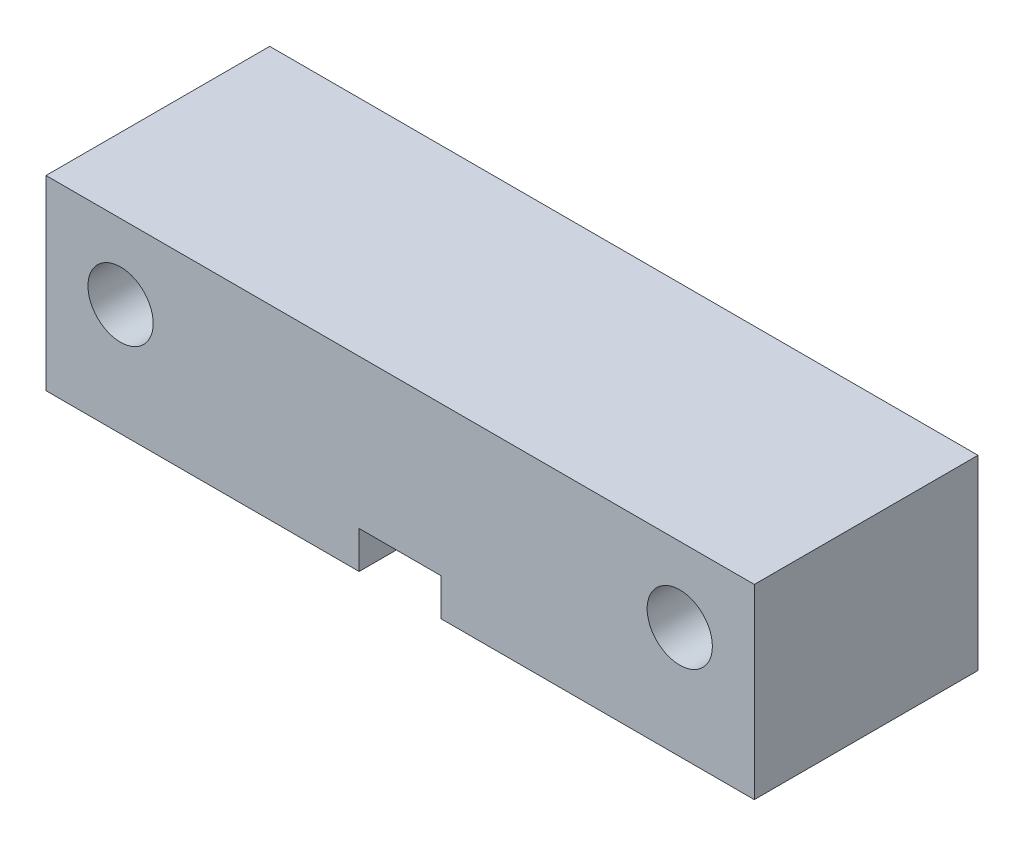
ISO-10303-21;
HEADER;
FILE_DESCRIPTION(('STEP AP214'),'2;1');
FILE_NAME('part.step','',(''),(''),'','','');
FILE_SCHEMA(('AUTOMOTIVE_DESIGN { 1 0 10303 214 1 1 1 1 }'));
ENDSEC;
DATA;
#1=APPLICATION_CONTEXT('core data for automotive mechanical design processes');
#2=APPLICATION_PROTOCOL_DEFINITION('international standard','automotive_design',2000,#1);
#3=PRODUCT_CONTEXT('',#1,'mechanical');
#4=PRODUCT('Part','Part','',(#3));
#5=PRODUCT_RELATED_PRODUCT_CATEGORY('part','',(#4));
#6=PRODUCT_DEFINITION_FORMATION('','',#4);
#7=PRODUCT_DEFINITION_CONTEXT('part definition',#1,'design');
#8=PRODUCT_DEFINITION('design','',#6,#7);
#9=PRODUCT_DEFINITION_SHAPE('','',#8);
#10=(LENGTH_UNIT() NAMED_UNIT(*) SI_UNIT(.MILLI.,.METRE.));
#11=(NAMED_UNIT(*) PLANE_ANGLE_UNIT() SI_UNIT($,.RADIAN.));
#12=(NAMED_UNIT(*) SI_UNIT($,.STERADIAN.) SOLID_ANGLE_UNIT());
#13=UNCERTAINTY_MEASURE_WITH_UNIT(LENGTH_MEASURE(1.E-05),#10,'distance_accuracy_value','');
#14=(GEOMETRIC_REPRESENTATION_CONTEXT(3) GLOBAL_UNCERTAINTY_ASSIGNED_CONTEXT((#13)) GLOBAL_UNIT_ASSIGNED_CONTEXT((#10,
#11,#12)) REPRESENTATION_CONTEXT('',''));
#15=CARTESIAN_POINT('',(0.,0.,0.));
#16=DIRECTION('',(0.,0.,1.));
#17=DIRECTION('',(1.,0.,0.));
#18=AXIS2_PLACEMENT_3D('',#15,#16,#17);
#19=CARTESIAN_POINT('',(-19.,-5.00000000000001,12.));
#20=DIRECTION('',(0.,1.,0.));
#21=DIRECTION('',(0.,0.,1.));
#22=AXIS2_PLACEMENT_3D('',#19,#20,#21);
#23=PLANE('',#22);
#24=DIRECTION('',(1.,0.,0.));
#25=VECTOR('',#24,1.);
#26=CARTESIAN_POINT('',(-19.,-5.00000000000001,12.));
#27=LINE('',#26,#25);
#28=CARTESIAN_POINT('',(2.19999999999999,-5.00000000000001,12.));
#29=VERTEX_POINT('',#28);
#30=CARTESIAN_POINT('',(19.,-5.00000000000001,12.));
#31=VERTEX_POINT('',#30);
#32=EDGE_CURVE('E57',#29,#31,#27,.T.);
#33=ORIENTED_EDGE('',*,*,#32,.F.);
#34=DIRECTION('',(0.,0.,1.));
#35=VECTOR('',#34,1.);
#36=CARTESIAN_POINT('',(2.19999999999999,-5.00000000000001,9.16835559787824));
#37=LINE('',#36,#35);
#38=CARTESIAN_POINT('',(2.19999999999999,-5.00000000000001,9.16835559787824));
#39=VERTEX_POINT('',#38);
#40=EDGE_CURVE('E167',#39,#29,#37,.T.);
#41=ORIENTED_EDGE('',*,*,#40,.F.);
#42=DIRECTION('',(-0.993819276773571,0.,0.111010112662116));
#43=VECTOR('',#42,1.);
#44=CARTESIAN_POINT('',(14.5498182027918,-5.00000000000001,7.78887469819257));
#45=LINE('',#44,#43);
#46=CARTESIAN_POINT('',(14.5498182027918,-5.00000000000001,7.78887469819257));
#47=VERTEX_POINT('',#46);
#48=EDGE_CURVE('E216',#47,#39,#45,.T.);
#49=ORIENTED_EDGE('',*,*,#48,.F.);
#50=CARTESIAN_POINT('',(14.35,-5.00000000000001,6.00000000000014));
#51=DIRECTION('',(0.,-1.,0.));
#52=DIRECTION('',(0.,0.,-1.));
#53=AXIS2_PLACEMENT_3D('',#50,#51,#52);
#54=CIRCLE('',#53,1.8);
#55=CARTESIAN_POINT('',(14.5498182027918,-5.00000000000001,4.21112530180771));
#56=VERTEX_POINT('',#55);
#57=EDGE_CURVE('E213',#56,#47,#54,.T.);
#58=ORIENTED_EDGE('',*,*,#57,.F.);
#59=DIRECTION('',(0.993819276773571,0.,0.111010112662117));
#60=VECTOR('',#59,1.);
#61=CARTESIAN_POINT('',(2.19999999999999,-5.00000000000001,2.83164440212202));
#62=LINE('',#61,#60);
#63=CARTESIAN_POINT('',(2.19999999999999,-5.00000000000001,2.83164440212202));
#64=VERTEX_POINT('',#63);
#65=EDGE_CURVE('E210',#64,#56,#62,.T.);
#66=ORIENTED_EDGE('',*,*,#65,.F.);
#67=DIRECTION('',(0.,0.,-1.));
#68=VECTOR('',#67,1.);
#69=CARTESIAN_POINT('',(2.19999999999999,-5.00000000000001,12.));
#70=LINE('',#69,#68);
#71=CARTESIAN_POINT('',(2.19999999999999,-5.00000000000001,0.));
#72=VERTEX_POINT('',#71);
#73=EDGE_CURVE('E41',#64,#72,#70,.T.);
#74=ORIENTED_EDGE('',*,*,#73,.T.);
#75=DIRECTION('',(1.,0.,0.));
#76=VECTOR('',#75,1.);
#77=CARTESIAN_POINT('',(-19.,-5.00000000000001,0.));
#78=LINE('',#77,#76);
#79=CARTESIAN_POINT('',(19.,-5.00000000000001,0.));
#80=VERTEX_POINT('',#79);
#81=EDGE_CURVE('E79',#72,#80,#78,.T.);
#82=ORIENTED_EDGE('',*,*,#81,.T.);
#83=DIRECTION('',(0.,0.,-1.));
#84=VECTOR('',#83,1.);
#85=CARTESIAN_POINT('',(19.,-5.00000000000001,12.));
#86=LINE('',#85,#84);
#87=EDGE_CURVE('E267',#31,#80,#86,.T.);
#88=ORIENTED_EDGE('',*,*,#87,.F.);
#89=EDGE_LOOP('',(#33,#41,#49,#58,#66,#74,#82,#88));
#90=FACE_BOUND('',#89,.T.);
#91=ADVANCED_FACE('F33',(#90),#23,.F.);
#92=CARTESIAN_POINT('',(0.,0.,12.));
#93=DIRECTION('',(0.,0.,1.));
#94=DIRECTION('',(1.,0.,0.));
#95=AXIS2_PLACEMENT_3D('',#92,#93,#94);
#96=PLANE('',#95);
#97=DIRECTION('',(0.,-1.,0.));
#98=VECTOR('',#97,1.);
#99=CARTESIAN_POINT('',(-2.2,0.,12.));
#100=LINE('',#99,#98);
#101=CARTESIAN_POINT('',(-2.2,-3.00000000000001,12.));
#102=VERTEX_POINT('',#101);
#103=CARTESIAN_POINT('',(-2.2,-5.00000000000001,12.));
#104=VERTEX_POINT('',#103);
#105=EDGE_CURVE('E242',#102,#104,#100,.T.);
#106=ORIENTED_EDGE('',*,*,#105,.F.);
#107=DIRECTION('',(1.,0.,0.));
#108=VECTOR('',#107,1.);
#109=CARTESIAN_POINT('',(0.,-3.00000000000001,12.));
#110=LINE('',#109,#108);
#111=CARTESIAN_POINT('',(2.19999999999999,-3.00000000000001,12.));
#112=VERTEX_POINT('',#111);
#113=EDGE_CURVE('E164',#102,#112,#110,.T.);
#114=ORIENTED_EDGE('',*,*,#113,.T.);
#115=DIRECTION('',(0.,1.,0.));
#116=VECTOR('',#115,1.);
#117=CARTESIAN_POINT('',(2.19999999999999,0.,12.));
#118=LINE('',#117,#116);
#119=EDGE_CURVE('E240',#29,#112,#118,.T.);
#120=ORIENTED_EDGE('',*,*,#119,.F.);
#121=ORIENTED_EDGE('',*,*,#32,.T.);
#122=DIRECTION('',(0.,1.,0.));
#123=VECTOR('',#122,1.);
#124=CARTESIAN_POINT('',(19.,4.99999999999999,12.));
#125=LINE('',#124,#123);
#126=CARTESIAN_POINT('',(19.,4.99999999999999,12.));
#127=VERTEX_POINT('',#126);
#128=EDGE_CURVE('E258',#31,#127,#125,.T.);
#129=ORIENTED_EDGE('',*,*,#128,.T.);
#130=DIRECTION('',(-1.,0.,0.));
#131=VECTOR('',#130,1.);
#132=CARTESIAN_POINT('',(-19.,5.00000000000002,12.));
#133=LINE('',#132,#131);
#134=CARTESIAN_POINT('',(-19.,5.00000000000002,12.));
#135=VERTEX_POINT('',#134);
#136=EDGE_CURVE('E87',#127,#135,#133,.T.);
#137=ORIENTED_EDGE('',*,*,#136,.T.);
#138=DIRECTION('',(0.,-1.,0.));
#139=VECTOR('',#138,1.);
#140=CARTESIAN_POINT('',(-19.,5.00000000000002,12.));
#141=LINE('',#140,#139);
#142=CARTESIAN_POINT('',(-19.,-5.00000000000001,12.));
#143=VERTEX_POINT('',#142);
#144=EDGE_CURVE('E262',#135,#143,#141,.T.);
#145=ORIENTED_EDGE('',*,*,#144,.T.);
#146=EDGE_CURVE('E264',#143,#104,#27,.T.);
#147=ORIENTED_EDGE('',*,*,#146,.T.);
#148=EDGE_LOOP('',(#106,#114,#120,#121,#129,#137,#145,#147));
#149=FACE_BOUND('',#148,.T.);
#150=CARTESIAN_POINT('',(15.,1.00000000000033,12.));
#151=DIRECTION('',(0.,0.,1.));
#152=DIRECTION('',(1.,0.,0.));
#153=AXIS2_PLACEMENT_3D('',#150,#151,#152);
#154=CIRCLE('',#153,1.75);
#155=CARTESIAN_POINT('',(16.75,1.00000000000033,12.));
#156=VERTEX_POINT('',#155);
#157=EDGE_CURVE('E252',#156,#156,#154,.T.);
#158=ORIENTED_EDGE('',*,*,#157,.F.);
#159=EDGE_LOOP('',(#158));
#160=FACE_BOUND('',#159,.T.);
#161=CARTESIAN_POINT('',(-15.,1.00000000000033,12.));
#162=DIRECTION('',(0.,0.,1.));
#163=DIRECTION('',(1.,0.,0.));
#164=AXIS2_PLACEMENT_3D('',#161,#162,#163);
#165=CIRCLE('',#164,1.75);
#166=CARTESIAN_POINT('',(-13.25,1.00000000000033,12.));
#167=VERTEX_POINT('',#166);
#168=EDGE_CURVE('E246',#167,#167,#165,.T.);
#169=ORIENTED_EDGE('',*,*,#168,.F.);
#170=EDGE_LOOP('',(#169));
#171=FACE_BOUND('',#170,.T.);
#172=ADVANCED_FACE('F303',(#149,#160,#171),#96,.T.);
#173=CARTESIAN_POINT('',(0.,0.,0.));
#174=DIRECTION('',(0.,0.,1.));
#175=DIRECTION('',(1.,0.,0.));
#176=AXIS2_PLACEMENT_3D('',#173,#174,#175);
#177=PLANE('',#176);
#178=ORIENTED_EDGE('',*,*,#81,.F.);
#179=DIRECTION('',(0.,1.,0.));
#180=VECTOR('',#179,1.);
#181=CARTESIAN_POINT('',(2.19999999999999,0.,0.));
#182=LINE('',#181,#180);
#183=CARTESIAN_POINT('',(2.19999999999999,-3.00000000000001,0.));
#184=VERTEX_POINT('',#183);
#185=EDGE_CURVE('E237',#72,#184,#182,.T.);
#186=ORIENTED_EDGE('',*,*,#185,.T.);
#187=DIRECTION('',(1.,0.,0.));
#188=VECTOR('',#187,1.);
#189=CARTESIAN_POINT('',(0.,-3.00000000000001,0.));
#190=LINE('',#189,#188);
#191=CARTESIAN_POINT('',(-2.2,-3.00000000000001,0.));
#192=VERTEX_POINT('',#191);
#193=EDGE_CURVE('E11',#192,#184,#190,.T.);
#194=ORIENTED_EDGE('',*,*,#193,.F.);
#195=DIRECTION('',(0.,-1.,0.));
#196=VECTOR('',#195,1.);
#197=CARTESIAN_POINT('',(-2.2,0.,0.));
#198=LINE('',#197,#196);
#199=CARTESIAN_POINT('',(-2.2,-5.00000000000001,0.));
#200=VERTEX_POINT('',#199);
#201=EDGE_CURVE('E222',#192,#200,#198,.T.);
#202=ORIENTED_EDGE('',*,*,#201,.T.);
#203=CARTESIAN_POINT('',(-19.,-5.00000000000001,0.));
#204=VERTEX_POINT('',#203);
#205=EDGE_CURVE('E260',#204,#200,#78,.T.);
#206=ORIENTED_EDGE('',*,*,#205,.F.);
#207=DIRECTION('',(0.,-1.,0.));
#208=VECTOR('',#207,1.);
#209=CARTESIAN_POINT('',(-19.,5.00000000000002,0.));
#210=LINE('',#209,#208);
#211=CARTESIAN_POINT('',(-19.,5.00000000000002,0.));
#212=VERTEX_POINT('',#211);
#213=EDGE_CURVE('E272',#212,#204,#210,.T.);
#214=ORIENTED_EDGE('',*,*,#213,.F.);
#215=DIRECTION('',(-1.,0.,0.));
#216=VECTOR('',#215,1.);
#217=CARTESIAN_POINT('',(-19.,5.00000000000002,0.));
#218=LINE('',#217,#216);
#219=CARTESIAN_POINT('',(19.,4.99999999999999,0.));
#220=VERTEX_POINT('',#219);
#221=EDGE_CURVE('E270',#220,#212,#218,.T.);
#222=ORIENTED_EDGE('',*,*,#221,.F.);
#223=DIRECTION('',(0.,1.,0.));
#224=VECTOR('',#223,1.);
#225=CARTESIAN_POINT('',(19.,4.99999999999999,0.));
#226=LINE('',#225,#224);
#227=EDGE_CURVE('E255',#80,#220,#226,.T.);
#228=ORIENTED_EDGE('',*,*,#227,.F.);
#229=EDGE_LOOP('',(#178,#186,#194,#202,#206,#214,#222,#228));
#230=FACE_BOUND('',#229,.T.);
#231=CARTESIAN_POINT('',(15.,1.00000000000033,0.));
#232=DIRECTION('',(0.,0.,1.));
#233=DIRECTION('',(1.,0.,0.));
#234=AXIS2_PLACEMENT_3D('',#231,#232,#233);
#235=CIRCLE('',#234,1.75);
#236=CARTESIAN_POINT('',(16.75,1.00000000000033,0.));
#237=VERTEX_POINT('',#236);
#238=EDGE_CURVE('E249',#237,#237,#235,.T.);
#239=ORIENTED_EDGE('',*,*,#238,.T.);
#240=EDGE_LOOP('',(#239));
#241=FACE_BOUND('',#240,.T.);
#242=CARTESIAN_POINT('',(-15.,1.00000000000033,0.));
#243=DIRECTION('',(0.,0.,1.));
#244=DIRECTION('',(1.,0.,0.));
#245=AXIS2_PLACEMENT_3D('',#242,#243,#244);
#246=CIRCLE('',#245,1.75);
#247=CARTESIAN_POINT('',(-13.25,1.00000000000033,0.));
#248=VERTEX_POINT('',#247);
#249=EDGE_CURVE('E245',#248,#248,#246,.T.);
#250=ORIENTED_EDGE('',*,*,#249,.T.);
#251=EDGE_LOOP('',(#250));
#252=FACE_BOUND('',#251,.T.);
#253=ADVANCED_FACE('F291',(#230,#241,#252),#177,.F.);
#254=CARTESIAN_POINT('',(19.,4.99999999999999,12.));
#255=DIRECTION('',(-1.,0.,0.));
#256=DIRECTION('',(0.,-1.,0.));
#257=AXIS2_PLACEMENT_3D('',#254,#255,#256);
#258=PLANE('',#257);
#259=ORIENTED_EDGE('',*,*,#227,.T.);
#260=DIRECTION('',(0.,0.,-1.));
#261=VECTOR('',#260,1.);
#262=CARTESIAN_POINT('',(19.,4.99999999999999,12.));
#263=LINE('',#262,#261);
#264=EDGE_CURVE('E283',#127,#220,#263,.T.);
#265=ORIENTED_EDGE('',*,*,#264,.F.);
#266=ORIENTED_EDGE('',*,*,#128,.F.);
#267=ORIENTED_EDGE('',*,*,#87,.T.);
#268=EDGE_LOOP('',(#259,#265,#266,#267));
#269=FACE_BOUND('',#268,.T.);
#270=ADVANCED_FACE('F35',(#269),#258,.F.);
#271=CARTESIAN_POINT('',(-19.,5.00000000000002,12.));
#272=DIRECTION('',(0.,-1.,0.));
#273=DIRECTION('',(1.,0.,0.));
#274=AXIS2_PLACEMENT_3D('',#271,#272,#273);
#275=PLANE('',#274);
#276=ORIENTED_EDGE('',*,*,#221,.T.);
#277=DIRECTION('',(0.,0.,-1.));
#278=VECTOR('',#277,1.);
#279=CARTESIAN_POINT('',(-19.,5.00000000000002,12.));
#280=LINE('',#279,#278);
#281=EDGE_CURVE('E280',#135,#212,#280,.T.);
#282=ORIENTED_EDGE('',*,*,#281,.F.);
#283=ORIENTED_EDGE('',*,*,#136,.F.);
#284=ORIENTED_EDGE('',*,*,#264,.T.);
#285=EDGE_LOOP('',(#276,#282,#283,#284));
#286=FACE_BOUND('',#285,.T.);
#287=ADVANCED_FACE('F324',(#286),#275,.F.);
#288=CARTESIAN_POINT('',(-19.,5.00000000000002,12.));
#289=DIRECTION('',(1.,0.,0.));
#290=DIRECTION('',(0.,0.,-1.));
#291=AXIS2_PLACEMENT_3D('',#288,#289,#290);
#292=PLANE('',#291);
#293=ORIENTED_EDGE('',*,*,#213,.T.);
#294=DIRECTION('',(0.,0.,-1.));
#295=VECTOR('',#294,1.);
#296=CARTESIAN_POINT('',(-19.,-5.00000000000001,12.));
#297=LINE('',#296,#295);
#298=EDGE_CURVE('E277',#143,#204,#297,.T.);
#299=ORIENTED_EDGE('',*,*,#298,.F.);
#300=ORIENTED_EDGE('',*,*,#144,.F.);
#301=ORIENTED_EDGE('',*,*,#281,.T.);
#302=EDGE_LOOP('',(#293,#299,#300,#301));
#303=FACE_BOUND('',#302,.T.);
#304=ADVANCED_FACE('F323',(#303),#292,.F.);
#305=DIRECTION('',(-0.991813926276863,0.,-0.127691564495361));
#306=VECTOR('',#305,1.);
#307=CARTESIAN_POINT('',(-2.20000000000001,-5.00000000000001,9.71385244622838));
#308=LINE('',#307,#306);
#309=CARTESIAN_POINT('',(-2.20000000000001,-5.00000000000001,9.71385244622838));
#310=VERTEX_POINT('',#309);
#311=CARTESIAN_POINT('',(-17.1798448160917,-5.00000000000001,7.78526506729848));
#312=VERTEX_POINT('',#311);
#313=EDGE_CURVE('E200',#310,#312,#308,.T.);
#314=ORIENTED_EDGE('',*,*,#313,.F.);
#315=DIRECTION('',(0.,0.,1.));
#316=VECTOR('',#315,1.);
#317=CARTESIAN_POINT('',(-2.2,-5.00000000000001,12.));
#318=LINE('',#317,#316);
#319=EDGE_CURVE('E171',#310,#104,#318,.T.);
#320=ORIENTED_EDGE('',*,*,#319,.T.);
#321=ORIENTED_EDGE('',*,*,#146,.F.);
#322=ORIENTED_EDGE('',*,*,#298,.T.);
#323=ORIENTED_EDGE('',*,*,#205,.T.);
#324=DIRECTION('',(0.,0.,-1.));
#325=VECTOR('',#324,1.);
#326=CARTESIAN_POINT('',(-2.2,-5.00000000000001,2.28614755377188));
#327=LINE('',#326,#325);
#328=CARTESIAN_POINT('',(-2.2,-5.00000000000001,2.28614755377188));
#329=VERTEX_POINT('',#328);
#330=EDGE_CURVE('E208',#329,#200,#327,.T.);
#331=ORIENTED_EDGE('',*,*,#330,.F.);
#332=DIRECTION('',(0.991813926276863,0.,-0.12769156449536));
#333=VECTOR('',#332,1.);
#334=CARTESIAN_POINT('',(-17.1798448160917,-5.00000000000001,4.21473493270177));
#335=LINE('',#334,#333);
#336=CARTESIAN_POINT('',(-17.1798448160917,-5.00000000000001,4.21473493270177));
#337=VERTEX_POINT('',#336);
#338=EDGE_CURVE('E205',#337,#329,#335,.T.);
#339=ORIENTED_EDGE('',*,*,#338,.F.);
#340=CARTESIAN_POINT('',(-16.95,-5.00000000000001,6.00000000000012));
#341=DIRECTION('',(0.,-1.,0.));
#342=DIRECTION('',(0.,0.,-1.));
#343=AXIS2_PLACEMENT_3D('',#340,#341,#342);
#344=CIRCLE('',#343,1.8);
#345=EDGE_CURVE('E202',#312,#337,#344,.T.);
#346=ORIENTED_EDGE('',*,*,#345,.F.);
#347=EDGE_LOOP('',(#314,#320,#321,#322,#323,#331,#339,#346));
#348=FACE_BOUND('',#347,.T.);
#349=ADVANCED_FACE('F307',(#348),#23,.F.);
#350=CARTESIAN_POINT('',(15.,1.00000000000033,12.));
#351=DIRECTION('',(0.,0.,-1.));
#352=DIRECTION('',(-1.,0.,0.));
#353=AXIS2_PLACEMENT_3D('',#350,#351,#352);
#354=CYLINDRICAL_SURFACE('',#353,1.75);
#355=ORIENTED_EDGE('',*,*,#157,.T.);
#356=EDGE_LOOP('',(#355));
#357=FACE_BOUND('',#356,.T.);
#358=ORIENTED_EDGE('',*,*,#238,.F.);
#359=EDGE_LOOP('',(#358));
#360=FACE_BOUND('',#359,.T.);
#361=ADVANCED_FACE('F339',(#357,#360),#354,.F.);
#362=CARTESIAN_POINT('',(-15.,1.00000000000033,12.));
#363=DIRECTION('',(0.,0.,-1.));
#364=DIRECTION('',(-1.,0.,0.));
#365=AXIS2_PLACEMENT_3D('',#362,#363,#364);
#366=CYLINDRICAL_SURFACE('',#365,1.75);
#367=ORIENTED_EDGE('',*,*,#168,.T.);
#368=EDGE_LOOP('',(#367));
#369=FACE_BOUND('',#368,.T.);
#370=ORIENTED_EDGE('',*,*,#249,.F.);
#371=EDGE_LOOP('',(#370));
#372=FACE_BOUND('',#371,.T.);
#373=ADVANCED_FACE('F343',(#369,#372),#366,.F.);
#374=CARTESIAN_POINT('',(-16.95,-3.00000000000001,6.00000000000012));
#375=DIRECTION('',(0.,-1.,0.));
#376=DIRECTION('',(0.,0.,-1.));
#377=AXIS2_PLACEMENT_3D('',#374,#375,#376);
#378=PLANE('',#377);
#379=DIRECTION('',(0.,0.,-1.));
#380=VECTOR('',#379,1.);
#381=CARTESIAN_POINT('',(-2.2,-3.00000000000001,12.7500000000001));
#382=LINE('',#381,#380);
#383=CARTESIAN_POINT('',(-2.20000000000001,-3.00000000000001,9.71385244622838));
#384=VERTEX_POINT('',#383);
#385=EDGE_CURVE('E158',#102,#384,#382,.T.);
#386=ORIENTED_EDGE('',*,*,#385,.T.);
#387=DIRECTION('',(-0.991813926276863,0.,-0.127691564495361));
#388=VECTOR('',#387,1.);
#389=CARTESIAN_POINT('',(-2.20000000000001,-3.00000000000001,9.71385244622838));
#390=LINE('',#389,#388);
#391=CARTESIAN_POINT('',(-17.1798448160917,-3.00000000000001,7.78526506729848));
#392=VERTEX_POINT('',#391);
#393=EDGE_CURVE('E161',#384,#392,#390,.T.);
#394=ORIENTED_EDGE('',*,*,#393,.T.);
#395=CARTESIAN_POINT('',(-16.95,-3.00000000000001,6.00000000000012));
#396=DIRECTION('',(0.,-1.,0.));
#397=DIRECTION('',(0.,0.,-1.));
#398=AXIS2_PLACEMENT_3D('',#395,#396,#397);
#399=CIRCLE('',#398,1.8);
#400=CARTESIAN_POINT('',(-17.1798448160917,-3.00000000000001,4.21473493270177));
#401=VERTEX_POINT('',#400);
#402=EDGE_CURVE('E178',#392,#401,#399,.T.);
#403=ORIENTED_EDGE('',*,*,#402,.T.);
#404=DIRECTION('',(0.991813926276863,0.,-0.12769156449536));
#405=VECTOR('',#404,1.);
#406=CARTESIAN_POINT('',(-17.1798448160917,-3.00000000000001,4.21473493270177));
#407=LINE('',#406,#405);
#408=CARTESIAN_POINT('',(-2.2,-3.00000000000001,2.28614755377188));
#409=VERTEX_POINT('',#408);
#410=EDGE_CURVE('E180',#401,#409,#407,.T.);
#411=ORIENTED_EDGE('',*,*,#410,.T.);
#412=DIRECTION('',(0.,0.,-1.));
#413=VECTOR('',#412,1.);
#414=CARTESIAN_POINT('',(-2.2,-3.00000000000001,2.28614755377188));
#415=LINE('',#414,#413);
#416=EDGE_CURVE('E185',#409,#192,#415,.T.);
#417=ORIENTED_EDGE('',*,*,#416,.T.);
#418=ORIENTED_EDGE('',*,*,#193,.T.);
#419=DIRECTION('',(0.,0.,1.));
#420=VECTOR('',#419,1.);
#421=CARTESIAN_POINT('',(2.19999999999999,-3.00000000000001,-0.0499999999998687));
#422=LINE('',#421,#420);
#423=CARTESIAN_POINT('',(2.19999999999999,-3.00000000000001,2.83164440212202));
#424=VERTEX_POINT('',#423);
#425=EDGE_CURVE('E188',#184,#424,#422,.T.);
#426=ORIENTED_EDGE('',*,*,#425,.T.);
#427=DIRECTION('',(0.993819276773571,0.,0.111010112662117));
#428=VECTOR('',#427,1.);
#429=CARTESIAN_POINT('',(2.19999999999999,-3.00000000000001,2.83164440212202));
#430=LINE('',#429,#428);
#431=CARTESIAN_POINT('',(14.5498182027918,-3.00000000000001,4.21112530180771));
#432=VERTEX_POINT('',#431);
#433=EDGE_CURVE('E190',#424,#432,#430,.T.);
#434=ORIENTED_EDGE('',*,*,#433,.T.);
#435=CARTESIAN_POINT('',(14.35,-3.00000000000001,6.00000000000014));
#436=DIRECTION('',(0.,-1.,0.));
#437=DIRECTION('',(0.,0.,-1.));
#438=AXIS2_PLACEMENT_3D('',#435,#436,#437);
#439=CIRCLE('',#438,1.8);
#440=CARTESIAN_POINT('',(14.5498182027918,-3.00000000000001,7.78887469819257));
#441=VERTEX_POINT('',#440);
#442=EDGE_CURVE('E193',#432,#441,#439,.T.);
#443=ORIENTED_EDGE('',*,*,#442,.T.);
#444=DIRECTION('',(-0.993819276773571,0.,0.111010112662116));
#445=VECTOR('',#444,1.);
#446=CARTESIAN_POINT('',(14.5498182027918,-3.00000000000001,7.78887469819257));
#447=LINE('',#446,#445);
#448=CARTESIAN_POINT('',(2.19999999999999,-3.00000000000001,9.16835559787824));
#449=VERTEX_POINT('',#448);
#450=EDGE_CURVE('E196',#441,#449,#447,.T.);
#451=ORIENTED_EDGE('',*,*,#450,.T.);
#452=DIRECTION('',(0.,0.,1.));
#453=VECTOR('',#452,1.);
#454=CARTESIAN_POINT('',(2.19999999999999,-3.00000000000001,9.16835559787824));
#455=LINE('',#454,#453);
#456=EDGE_CURVE('E174',#449,#112,#455,.T.);
#457=ORIENTED_EDGE('',*,*,#456,.T.);
#458=ORIENTED_EDGE('',*,*,#113,.F.);
#459=EDGE_LOOP('',(#386,#394,#403,#411,#417,#418,#426,#434,#443,#451,#457,#458));
#460=FACE_BOUND('',#459,.T.);
#461=ADVANCED_FACE('F159',(#460),#378,.T.);
#462=CARTESIAN_POINT('',(2.19999999999999,-3.00000000000001,-0.0499999999998687));
#463=DIRECTION('',(1.,0.,0.));
#464=DIRECTION('',(0.,0.,-1.));
#465=AXIS2_PLACEMENT_3D('',#462,#463,#464);
#466=PLANE('',#465);
#467=ORIENTED_EDGE('',*,*,#73,.F.);
#468=DIRECTION('',(0.,-1.,0.));
#469=VECTOR('',#468,1.);
#470=CARTESIAN_POINT('',(2.19999999999999,-3.00000000000001,2.83164440212202));
#471=LINE('',#470,#469);
#472=EDGE_CURVE('E227',#424,#64,#471,.T.);
#473=ORIENTED_EDGE('',*,*,#472,.F.);
#474=ORIENTED_EDGE('',*,*,#425,.F.);
#475=ORIENTED_EDGE('',*,*,#185,.F.);
#476=EDGE_LOOP('',(#467,#473,#474,#475));
#477=FACE_BOUND('',#476,.T.);
#478=ADVANCED_FACE('F403',(#477),#466,.F.);
#479=CARTESIAN_POINT('',(-2.2,-3.00000000000001,2.28614755377188));
#480=DIRECTION('',(-1.,0.,0.));
#481=DIRECTION('',(0.,0.,1.));
#482=AXIS2_PLACEMENT_3D('',#479,#480,#481);
#483=PLANE('',#482);
#484=ORIENTED_EDGE('',*,*,#416,.F.);
#485=DIRECTION('',(0.,-1.,0.));
#486=VECTOR('',#485,1.);
#487=CARTESIAN_POINT('',(-2.2,-3.00000000000001,2.28614755377188));
#488=LINE('',#487,#486);
#489=EDGE_CURVE('E230',#409,#329,#488,.T.);
#490=ORIENTED_EDGE('',*,*,#489,.T.);
#491=ORIENTED_EDGE('',*,*,#330,.T.);
#492=ORIENTED_EDGE('',*,*,#201,.F.);
#493=EDGE_LOOP('',(#484,#490,#491,#492));
#494=FACE_BOUND('',#493,.T.);
#495=ADVANCED_FACE('F318',(#494),#483,.F.);
#496=CARTESIAN_POINT('',(-2.2,-3.00000000000001,12.7500000000001));
#497=DIRECTION('',(-1.,0.,0.));
#498=DIRECTION('',(0.,0.,1.));
#499=AXIS2_PLACEMENT_3D('',#496,#497,#498);
#500=PLANE('',#499);
#501=ORIENTED_EDGE('',*,*,#105,.T.);
#502=ORIENTED_EDGE('',*,*,#319,.F.);
#503=DIRECTION('',(0.,-1.,0.));
#504=VECTOR('',#503,1.);
#505=CARTESIAN_POINT('',(-2.20000000000001,-3.00000000000001,9.71385244622838));
#506=LINE('',#505,#504);
#507=EDGE_CURVE('E48',#384,#310,#506,.T.);
#508=ORIENTED_EDGE('',*,*,#507,.F.);
#509=ORIENTED_EDGE('',*,*,#385,.F.);
#510=EDGE_LOOP('',(#501,#502,#508,#509));
#511=FACE_BOUND('',#510,.T.);
#512=ADVANCED_FACE('F169',(#511),#500,.F.);
#513=CARTESIAN_POINT('',(2.19999999999999,-3.00000000000001,9.16835559787824));
#514=DIRECTION('',(1.,0.,0.));
#515=DIRECTION('',(0.,0.,-1.));
#516=AXIS2_PLACEMENT_3D('',#513,#514,#515);
#517=PLANE('',#516);
#518=ORIENTED_EDGE('',*,*,#119,.T.);
#519=ORIENTED_EDGE('',*,*,#456,.F.);
#520=DIRECTION('',(0.,-1.,0.));
#521=VECTOR('',#520,1.);
#522=CARTESIAN_POINT('',(2.19999999999999,-3.00000000000001,9.16835559787824));
#523=LINE('',#522,#521);
#524=EDGE_CURVE('E220',#449,#39,#523,.T.);
#525=ORIENTED_EDGE('',*,*,#524,.T.);
#526=ORIENTED_EDGE('',*,*,#40,.T.);
#527=EDGE_LOOP('',(#518,#519,#525,#526));
#528=FACE_BOUND('',#527,.T.);
#529=ADVANCED_FACE('F301',(#528),#517,.F.);
#530=CARTESIAN_POINT('',(14.5498182027918,-3.00000000000001,7.78887469819257));
#531=DIRECTION('',(0.111010112662116,0.,0.993819276773571));
#532=DIRECTION('',(0.993819276773571,0.,-0.111010112662116));
#533=AXIS2_PLACEMENT_3D('',#530,#531,#532);
#534=PLANE('',#533);
#535=ORIENTED_EDGE('',*,*,#48,.T.);
#536=ORIENTED_EDGE('',*,*,#524,.F.);
#537=ORIENTED_EDGE('',*,*,#450,.F.);
#538=DIRECTION('',(0.,-1.,0.));
#539=VECTOR('',#538,1.);
#540=CARTESIAN_POINT('',(14.5498182027918,-3.00000000000001,7.78887469819257));
#541=LINE('',#540,#539);
#542=EDGE_CURVE('E223',#441,#47,#541,.T.);
#543=ORIENTED_EDGE('',*,*,#542,.T.);
#544=EDGE_LOOP('',(#535,#536,#537,#543));
#545=FACE_BOUND('',#544,.T.);
#546=ADVANCED_FACE('F431',(#545),#534,.F.);
#547=CARTESIAN_POINT('',(14.35,-3.00000000000001,6.00000000000014));
#548=DIRECTION('',(0.,-1.,0.));
#549=DIRECTION('',(0.,0.,-1.));
#550=AXIS2_PLACEMENT_3D('',#547,#548,#549);
#551=CYLINDRICAL_SURFACE('',#550,1.8);
#552=ORIENTED_EDGE('',*,*,#57,.T.);
#553=ORIENTED_EDGE('',*,*,#542,.F.);
#554=ORIENTED_EDGE('',*,*,#442,.F.);
#555=DIRECTION('',(0.,-1.,0.));
#556=VECTOR('',#555,1.);
#557=CARTESIAN_POINT('',(14.5498182027918,-3.00000000000001,4.21112530180771));
#558=LINE('',#557,#556);
#559=EDGE_CURVE('E225',#432,#56,#558,.T.);
#560=ORIENTED_EDGE('',*,*,#559,.T.);
#561=EDGE_LOOP('',(#552,#553,#554,#560));
#562=FACE_BOUND('',#561,.T.);
#563=ADVANCED_FACE('F439',(#562),#551,.F.);
#564=CARTESIAN_POINT('',(2.19999999999999,-3.00000000000001,2.83164440212202));
#565=DIRECTION('',(0.111010112662117,0.,-0.993819276773571));
#566=DIRECTION('',(-0.993819276773571,0.,-0.111010112662117));
#567=AXIS2_PLACEMENT_3D('',#564,#565,#566);
#568=PLANE('',#567);
#569=ORIENTED_EDGE('',*,*,#65,.T.);
#570=ORIENTED_EDGE('',*,*,#559,.F.);
#571=ORIENTED_EDGE('',*,*,#433,.F.);
#572=ORIENTED_EDGE('',*,*,#472,.T.);
#573=EDGE_LOOP('',(#569,#570,#571,#572));
#574=FACE_BOUND('',#573,.T.);
#575=ADVANCED_FACE('F448',(#574),#568,.F.);
#576=CARTESIAN_POINT('',(-17.1798448160917,-3.00000000000001,4.21473493270177));
#577=DIRECTION('',(-0.12769156449536,0.,-0.991813926276863));
#578=DIRECTION('',(-0.991813926276863,0.,0.12769156449536));
#579=AXIS2_PLACEMENT_3D('',#576,#577,#578);
#580=PLANE('',#579);
#581=ORIENTED_EDGE('',*,*,#338,.T.);
#582=ORIENTED_EDGE('',*,*,#489,.F.);
#583=ORIENTED_EDGE('',*,*,#410,.F.);
#584=DIRECTION('',(0.,-1.,0.));
#585=VECTOR('',#584,1.);
#586=CARTESIAN_POINT('',(-17.1798448160917,-3.00000000000001,4.21473493270177));
#587=LINE('',#586,#585);
#588=EDGE_CURVE('E232',#401,#337,#587,.T.);
#589=ORIENTED_EDGE('',*,*,#588,.T.);
#590=EDGE_LOOP('',(#581,#582,#583,#589));
#591=FACE_BOUND('',#590,.T.);
#592=ADVANCED_FACE('F316',(#591),#580,.F.);
#593=CARTESIAN_POINT('',(-16.95,-3.00000000000001,6.00000000000012));
#594=DIRECTION('',(0.,-1.,0.));
#595=DIRECTION('',(0.,0.,-1.));
#596=AXIS2_PLACEMENT_3D('',#593,#594,#595);
#597=CYLINDRICAL_SURFACE('',#596,1.8);
#598=ORIENTED_EDGE('',*,*,#345,.T.);
#599=ORIENTED_EDGE('',*,*,#588,.F.);
#600=ORIENTED_EDGE('',*,*,#402,.F.);
#601=DIRECTION('',(0.,-1.,0.));
#602=VECTOR('',#601,1.);
#603=CARTESIAN_POINT('',(-17.1798448160917,-3.00000000000001,7.78526506729848));
#604=LINE('',#603,#602);
#605=EDGE_CURVE('E173',#392,#312,#604,.T.);
#606=ORIENTED_EDGE('',*,*,#605,.T.);
#607=EDGE_LOOP('',(#598,#599,#600,#606));
#608=FACE_BOUND('',#607,.T.);
#609=ADVANCED_FACE('F312',(#608),#597,.F.);
#610=CARTESIAN_POINT('',(-2.20000000000001,-3.00000000000001,9.71385244622838));
#611=DIRECTION('',(-0.127691564495361,0.,0.991813926276863));
#612=DIRECTION('',(0.991813926276863,0.,0.127691564495361));
#613=AXIS2_PLACEMENT_3D('',#610,#611,#612);
#614=PLANE('',#613);
#615=ORIENTED_EDGE('',*,*,#313,.T.);
#616=ORIENTED_EDGE('',*,*,#605,.F.);
#617=ORIENTED_EDGE('',*,*,#393,.F.);
#618=ORIENTED_EDGE('',*,*,#507,.T.);
#619=EDGE_LOOP('',(#615,#616,#617,#618));
#620=FACE_BOUND('',#619,.T.);
#621=ADVANCED_FACE('F176',(#620),#614,.F.);
#622=CLOSED_SHELL('',(#91,#172,#253,#270,#287,#304,#349,#361,#373,#461,#478,#495,#512,#529,#546,
#563,#575,#592,#609,#621));
#623=MANIFOLD_SOLID_BREP('B2',#622);
#624=ADVANCED_BREP_SHAPE_REPRESENTATION('',(#18,#623),#14);
#625=SHAPE_DEFINITION_REPRESENTATION(#9,#624);
ENDSEC;
END-ISO-10303-21;
